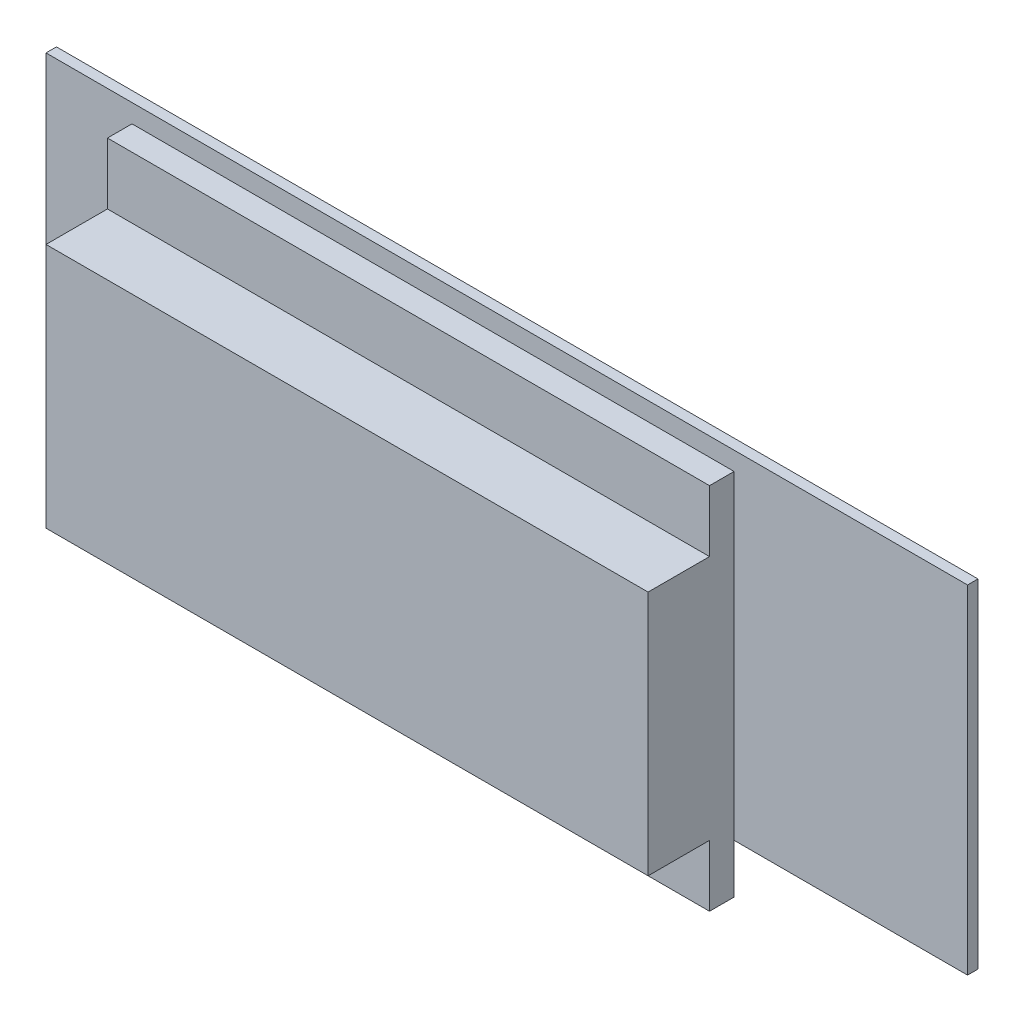
ISO-10303-21;
HEADER;
FILE_DESCRIPTION(('STEP AP214'),'2;1');
FILE_NAME('part.step','',(''),(''),'','','');
FILE_SCHEMA(('AUTOMOTIVE_DESIGN { 1 0 10303 214 1 1 1 1 }'));
ENDSEC;
DATA;
#1=APPLICATION_CONTEXT('core data for automotive mechanical design processes');
#2=APPLICATION_PROTOCOL_DEFINITION('international standard','automotive_design',2000,#1);
#3=PRODUCT_CONTEXT('',#1,'mechanical');
#4=PRODUCT('Part','Part','',(#3));
#5=PRODUCT_RELATED_PRODUCT_CATEGORY('part','',(#4));
#6=PRODUCT_DEFINITION_FORMATION('','',#4);
#7=PRODUCT_DEFINITION_CONTEXT('part definition',#1,'design');
#8=PRODUCT_DEFINITION('design','',#6,#7);
#9=PRODUCT_DEFINITION_SHAPE('','',#8);
#10=(LENGTH_UNIT() NAMED_UNIT(*) SI_UNIT(.MILLI.,.METRE.));
#11=(NAMED_UNIT(*) PLANE_ANGLE_UNIT() SI_UNIT($,.RADIAN.));
#12=(NAMED_UNIT(*) SI_UNIT($,.STERADIAN.) SOLID_ANGLE_UNIT());
#13=UNCERTAINTY_MEASURE_WITH_UNIT(LENGTH_MEASURE(1.E-05),#10,'distance_accuracy_value','');
#14=(GEOMETRIC_REPRESENTATION_CONTEXT(3) GLOBAL_UNCERTAINTY_ASSIGNED_CONTEXT((#13)) GLOBAL_UNIT_ASSIGNED_CONTEXT((#10,
#11,#12)) REPRESENTATION_CONTEXT('',''));
#15=CARTESIAN_POINT('',(0.,0.,0.));
#16=DIRECTION('',(0.,0.,1.));
#17=DIRECTION('',(1.,0.,0.));
#18=AXIS2_PLACEMENT_3D('',#15,#16,#17);
#19=CARTESIAN_POINT('',(0.,0.,5.7));
#20=DIRECTION('',(0.,0.,-1.));
#21=DIRECTION('',(-1.,0.,0.));
#22=AXIS2_PLACEMENT_3D('',#19,#20,#21);
#23=PLANE('',#22);
#24=DIRECTION('',(-1.,0.,0.));
#25=VECTOR('',#24,1.);
#26=CARTESIAN_POINT('',(-61.,14.5,5.7));
#27=LINE('',#26,#25);
#28=CARTESIAN_POINT('',(37.,14.5,5.7));
#29=VERTEX_POINT('',#28);
#30=CARTESIAN_POINT('',(-61.,14.5,5.7));
#31=VERTEX_POINT('',#30);
#32=EDGE_CURVE('E53',#29,#31,#27,.T.);
#33=ORIENTED_EDGE('',*,*,#32,.F.);
#34=DIRECTION('',(0.,1.,0.));
#35=VECTOR('',#34,1.);
#36=CARTESIAN_POINT('',(37.,24.5,5.7));
#37=LINE('',#36,#35);
#38=CARTESIAN_POINT('',(37.,24.5,5.7));
#39=VERTEX_POINT('',#38);
#40=EDGE_CURVE('E242',#29,#39,#37,.T.);
#41=ORIENTED_EDGE('',*,*,#40,.T.);
#42=DIRECTION('',(-1.,0.,0.));
#43=VECTOR('',#42,1.);
#44=CARTESIAN_POINT('',(-61.,24.5,5.7));
#45=LINE('',#44,#43);
#46=CARTESIAN_POINT('',(-61.,24.5,5.7));
#47=VERTEX_POINT('',#46);
#48=EDGE_CURVE('E178',#39,#47,#45,.T.);
#49=ORIENTED_EDGE('',*,*,#48,.T.);
#50=DIRECTION('',(0.,-1.,0.));
#51=VECTOR('',#50,1.);
#52=CARTESIAN_POINT('',(-61.,24.5,5.7));
#53=LINE('',#52,#51);
#54=EDGE_CURVE('E189',#47,#31,#53,.T.);
#55=ORIENTED_EDGE('',*,*,#54,.T.);
#56=EDGE_LOOP('',(#33,#41,#49,#55));
#57=FACE_BOUND('',#56,.T.);
#58=ADVANCED_FACE('F35',(#57),#23,.F.);
#59=DIRECTION('',(1.,0.,0.));
#60=VECTOR('',#59,1.);
#61=CARTESIAN_POINT('',(-61.,-25.5,5.7));
#62=LINE('',#61,#60);
#63=CARTESIAN_POINT('',(-61.,-25.5,5.7));
#64=VERTEX_POINT('',#63);
#65=CARTESIAN_POINT('',(37.,-25.5,5.7));
#66=VERTEX_POINT('',#65);
#67=EDGE_CURVE('E61',#64,#66,#62,.T.);
#68=ORIENTED_EDGE('',*,*,#67,.F.);
#69=CARTESIAN_POINT('',(-61.,-35.5,5.7));
#70=VERTEX_POINT('',#69);
#71=EDGE_CURVE('E156',#64,#70,#53,.T.);
#72=ORIENTED_EDGE('',*,*,#71,.T.);
#73=DIRECTION('',(1.,0.,0.));
#74=VECTOR('',#73,1.);
#75=CARTESIAN_POINT('',(-61.,-35.5,5.7));
#76=LINE('',#75,#74);
#77=CARTESIAN_POINT('',(37.,-35.5,5.7));
#78=VERTEX_POINT('',#77);
#79=EDGE_CURVE('E183',#70,#78,#76,.T.);
#80=ORIENTED_EDGE('',*,*,#79,.T.);
#81=EDGE_CURVE('E233',#78,#66,#37,.T.);
#82=ORIENTED_EDGE('',*,*,#81,.T.);
#83=EDGE_LOOP('',(#68,#72,#80,#82));
#84=FACE_BOUND('',#83,.T.);
#85=ADVANCED_FACE('F248',(#84),#23,.F.);
#86=CARTESIAN_POINT('',(-75.,-27.5,1.7));
#87=DIRECTION('',(1.,0.,0.));
#88=DIRECTION('',(0.,0.,-1.));
#89=AXIS2_PLACEMENT_3D('',#86,#87,#88);
#90=PLANE('',#89);
#91=DIRECTION('',(0.,-1.,0.));
#92=VECTOR('',#91,1.);
#93=CARTESIAN_POINT('',(-75.,-27.5,0.));
#94=LINE('',#93,#92);
#95=CARTESIAN_POINT('',(-75.,27.5,0.));
#96=VERTEX_POINT('',#95);
#97=CARTESIAN_POINT('',(-75.,-27.5,0.));
#98=VERTEX_POINT('',#97);
#99=EDGE_CURVE('E210',#96,#98,#94,.T.);
#100=ORIENTED_EDGE('',*,*,#99,.T.);
#101=DIRECTION('',(0.,0.,-1.));
#102=VECTOR('',#101,1.);
#103=CARTESIAN_POINT('',(-75.,-27.5,1.7));
#104=LINE('',#103,#102);
#105=CARTESIAN_POINT('',(-75.,-27.5,1.7));
#106=VERTEX_POINT('',#105);
#107=EDGE_CURVE('E44',#106,#98,#104,.T.);
#108=ORIENTED_EDGE('',*,*,#107,.F.);
#109=DIRECTION('',(0.,-1.,0.));
#110=VECTOR('',#109,1.);
#111=CARTESIAN_POINT('',(-75.,-27.5,1.7));
#112=LINE('',#111,#110);
#113=CARTESIAN_POINT('',(-75.,27.5,1.7));
#114=VERTEX_POINT('',#113);
#115=EDGE_CURVE('E205',#114,#106,#112,.T.);
#116=ORIENTED_EDGE('',*,*,#115,.F.);
#117=DIRECTION('',(0.,0.,-1.));
#118=VECTOR('',#117,1.);
#119=CARTESIAN_POINT('',(-75.,27.5,1.7));
#120=LINE('',#119,#118);
#121=EDGE_CURVE('E199',#114,#96,#120,.T.);
#122=ORIENTED_EDGE('',*,*,#121,.T.);
#123=EDGE_LOOP('',(#100,#108,#116,#122));
#124=FACE_BOUND('',#123,.T.);
#125=ADVANCED_FACE('F37',(#124),#90,.F.);
#126=CARTESIAN_POINT('',(75.,-27.5,1.7));
#127=DIRECTION('',(0.,1.,0.));
#128=DIRECTION('',(-1.,0.,0.));
#129=AXIS2_PLACEMENT_3D('',#126,#127,#128);
#130=PLANE('',#129);
#131=DIRECTION('',(1.,0.,0.));
#132=VECTOR('',#131,1.);
#133=CARTESIAN_POINT('',(75.,-27.5,0.));
#134=LINE('',#133,#132);
#135=CARTESIAN_POINT('',(75.,-27.5,0.));
#136=VERTEX_POINT('',#135);
#137=EDGE_CURVE('E208',#98,#136,#134,.T.);
#138=ORIENTED_EDGE('',*,*,#137,.T.);
#139=DIRECTION('',(0.,0.,-1.));
#140=VECTOR('',#139,1.);
#141=CARTESIAN_POINT('',(75.,-27.5,1.7));
#142=LINE('',#141,#140);
#143=CARTESIAN_POINT('',(75.,-27.5,1.7));
#144=VERTEX_POINT('',#143);
#145=EDGE_CURVE('E193',#144,#136,#142,.T.);
#146=ORIENTED_EDGE('',*,*,#145,.F.);
#147=DIRECTION('',(1.,0.,0.));
#148=VECTOR('',#147,1.);
#149=CARTESIAN_POINT('',(75.,-27.5,1.7));
#150=LINE('',#149,#148);
#151=CARTESIAN_POINT('',(37.,-27.5,1.7));
#152=VERTEX_POINT('',#151);
#153=EDGE_CURVE('E220',#152,#144,#150,.T.);
#154=ORIENTED_EDGE('',*,*,#153,.F.);
#155=CARTESIAN_POINT('',(-61.,-27.5,1.7));
#156=VERTEX_POINT('',#155);
#157=EDGE_CURVE('E219',#156,#152,#150,.T.);
#158=ORIENTED_EDGE('',*,*,#157,.F.);
#159=EDGE_CURVE('E217',#106,#156,#150,.T.);
#160=ORIENTED_EDGE('',*,*,#159,.F.);
#161=ORIENTED_EDGE('',*,*,#107,.T.);
#162=EDGE_LOOP('',(#138,#146,#154,#158,#160,#161));
#163=FACE_BOUND('',#162,.T.);
#164=ADVANCED_FACE('F303',(#163),#130,.F.);
#165=CARTESIAN_POINT('',(75.,-27.5,1.7));
#166=DIRECTION('',(-1.,0.,0.));
#167=DIRECTION('',(0.,0.,1.));
#168=AXIS2_PLACEMENT_3D('',#165,#166,#167);
#169=PLANE('',#168);
#170=DIRECTION('',(0.,1.,0.));
#171=VECTOR('',#170,1.);
#172=CARTESIAN_POINT('',(75.,-27.5,0.));
#173=LINE('',#172,#171);
#174=CARTESIAN_POINT('',(75.,27.5,0.));
#175=VERTEX_POINT('',#174);
#176=EDGE_CURVE('E206',#136,#175,#173,.T.);
#177=ORIENTED_EDGE('',*,*,#176,.T.);
#178=DIRECTION('',(0.,0.,-1.));
#179=VECTOR('',#178,1.);
#180=CARTESIAN_POINT('',(75.,27.5,1.7));
#181=LINE('',#180,#179);
#182=CARTESIAN_POINT('',(75.,27.5,1.7));
#183=VERTEX_POINT('',#182);
#184=EDGE_CURVE('E196',#183,#175,#181,.T.);
#185=ORIENTED_EDGE('',*,*,#184,.F.);
#186=DIRECTION('',(0.,1.,0.));
#187=VECTOR('',#186,1.);
#188=CARTESIAN_POINT('',(75.,-27.5,1.7));
#189=LINE('',#188,#187);
#190=EDGE_CURVE('E215',#144,#183,#189,.T.);
#191=ORIENTED_EDGE('',*,*,#190,.F.);
#192=ORIENTED_EDGE('',*,*,#145,.T.);
#193=EDGE_LOOP('',(#177,#185,#191,#192));
#194=FACE_BOUND('',#193,.T.);
#195=ADVANCED_FACE('F300',(#194),#169,.F.);
#196=CARTESIAN_POINT('',(75.,27.5,1.7));
#197=DIRECTION('',(0.,-1.,0.));
#198=DIRECTION('',(1.,0.,0.));
#199=AXIS2_PLACEMENT_3D('',#196,#197,#198);
#200=PLANE('',#199);
#201=DIRECTION('',(-1.,0.,0.));
#202=VECTOR('',#201,1.);
#203=CARTESIAN_POINT('',(75.,27.5,0.));
#204=LINE('',#203,#202);
#205=EDGE_CURVE('E203',#175,#96,#204,.T.);
#206=ORIENTED_EDGE('',*,*,#205,.T.);
#207=ORIENTED_EDGE('',*,*,#121,.F.);
#208=DIRECTION('',(-1.,0.,0.));
#209=VECTOR('',#208,1.);
#210=CARTESIAN_POINT('',(75.,27.5,1.7));
#211=LINE('',#210,#209);
#212=EDGE_CURVE('E202',#183,#114,#211,.T.);
#213=ORIENTED_EDGE('',*,*,#212,.F.);
#214=ORIENTED_EDGE('',*,*,#184,.T.);
#215=EDGE_LOOP('',(#206,#207,#213,#214));
#216=FACE_BOUND('',#215,.T.);
#217=ADVANCED_FACE('F293',(#216),#200,.F.);
#218=CARTESIAN_POINT('',(0.,0.,1.7));
#219=DIRECTION('',(0.,0.,1.));
#220=DIRECTION('',(1.,0.,0.));
#221=AXIS2_PLACEMENT_3D('',#218,#219,#220);
#222=PLANE('',#221);
#223=DIRECTION('',(0.,1.,0.));
#224=VECTOR('',#223,1.);
#225=CARTESIAN_POINT('',(37.,24.5,1.7));
#226=LINE('',#225,#224);
#227=CARTESIAN_POINT('',(37.,24.5,1.7));
#228=VERTEX_POINT('',#227);
#229=EDGE_CURVE('E11',#152,#228,#226,.T.);
#230=ORIENTED_EDGE('',*,*,#229,.F.);
#231=ORIENTED_EDGE('',*,*,#153,.T.);
#232=ORIENTED_EDGE('',*,*,#190,.T.);
#233=ORIENTED_EDGE('',*,*,#212,.T.);
#234=ORIENTED_EDGE('',*,*,#115,.T.);
#235=ORIENTED_EDGE('',*,*,#159,.T.);
#236=DIRECTION('',(0.,-1.,0.));
#237=VECTOR('',#236,1.);
#238=CARTESIAN_POINT('',(-61.,24.5,1.7));
#239=LINE('',#238,#237);
#240=CARTESIAN_POINT('',(-61.,24.5,1.7));
#241=VERTEX_POINT('',#240);
#242=EDGE_CURVE('E238',#241,#156,#239,.T.);
#243=ORIENTED_EDGE('',*,*,#242,.F.);
#244=DIRECTION('',(-1.,0.,0.));
#245=VECTOR('',#244,1.);
#246=CARTESIAN_POINT('',(-61.,24.5,1.7));
#247=LINE('',#246,#245);
#248=EDGE_CURVE('E157',#228,#241,#247,.T.);
#249=ORIENTED_EDGE('',*,*,#248,.F.);
#250=EDGE_LOOP('',(#230,#231,#232,#233,#234,#235,#243,#249));
#251=FACE_BOUND('',#250,.T.);
#252=ADVANCED_FACE('F290',(#251),#222,.T.);
#253=CARTESIAN_POINT('',(0.,0.,0.));
#254=DIRECTION('',(0.,0.,1.));
#255=DIRECTION('',(1.,0.,0.));
#256=AXIS2_PLACEMENT_3D('',#253,#254,#255);
#257=PLANE('',#256);
#258=ORIENTED_EDGE('',*,*,#99,.F.);
#259=ORIENTED_EDGE('',*,*,#205,.F.);
#260=ORIENTED_EDGE('',*,*,#176,.F.);
#261=ORIENTED_EDGE('',*,*,#137,.F.);
#262=EDGE_LOOP('',(#258,#259,#260,#261));
#263=FACE_BOUND('',#262,.T.);
#264=ADVANCED_FACE('F288',(#263),#257,.F.);
#265=CARTESIAN_POINT('',(-61.,24.5,5.7));
#266=DIRECTION('',(0.,-1.,0.));
#267=DIRECTION('',(0.,0.,-1.));
#268=AXIS2_PLACEMENT_3D('',#265,#266,#267);
#269=PLANE('',#268);
#270=ORIENTED_EDGE('',*,*,#248,.T.);
#271=DIRECTION('',(0.,0.,-1.));
#272=VECTOR('',#271,1.);
#273=CARTESIAN_POINT('',(-61.,24.5,5.7));
#274=LINE('',#273,#272);
#275=EDGE_CURVE('E213',#47,#241,#274,.T.);
#276=ORIENTED_EDGE('',*,*,#275,.F.);
#277=ORIENTED_EDGE('',*,*,#48,.F.);
#278=DIRECTION('',(0.,0.,-1.));
#279=VECTOR('',#278,1.);
#280=CARTESIAN_POINT('',(37.,24.5,5.7));
#281=LINE('',#280,#279);
#282=EDGE_CURVE('E231',#39,#228,#281,.T.);
#283=ORIENTED_EDGE('',*,*,#282,.T.);
#284=EDGE_LOOP('',(#270,#276,#277,#283));
#285=FACE_BOUND('',#284,.T.);
#286=ADVANCED_FACE('F285',(#285),#269,.F.);
#287=CARTESIAN_POINT('',(-61.,24.5,5.7));
#288=DIRECTION('',(1.,0.,0.));
#289=DIRECTION('',(0.,1.,0.));
#290=AXIS2_PLACEMENT_3D('',#287,#288,#289);
#291=PLANE('',#290);
#292=ORIENTED_EDGE('',*,*,#242,.T.);
#293=CARTESIAN_POINT('',(-61.,-35.5,1.7));
#294=VERTEX_POINT('',#293);
#295=EDGE_CURVE('E160',#156,#294,#239,.T.);
#296=ORIENTED_EDGE('',*,*,#295,.T.);
#297=DIRECTION('',(0.,0.,-1.));
#298=VECTOR('',#297,1.);
#299=CARTESIAN_POINT('',(-61.,-35.5,5.7));
#300=LINE('',#299,#298);
#301=EDGE_CURVE('E225',#70,#294,#300,.T.);
#302=ORIENTED_EDGE('',*,*,#301,.F.);
#303=ORIENTED_EDGE('',*,*,#71,.F.);
#304=DIRECTION('',(0.,0.,-1.));
#305=VECTOR('',#304,1.);
#306=CARTESIAN_POINT('',(-61.,-25.5,15.7));
#307=LINE('',#306,#305);
#308=CARTESIAN_POINT('',(-61.,-25.5,15.7));
#309=VERTEX_POINT('',#308);
#310=EDGE_CURVE('E137',#309,#64,#307,.T.);
#311=ORIENTED_EDGE('',*,*,#310,.F.);
#312=DIRECTION('',(0.,-1.,0.));
#313=VECTOR('',#312,1.);
#314=CARTESIAN_POINT('',(-61.,14.5,15.7));
#315=LINE('',#314,#313);
#316=CARTESIAN_POINT('',(-61.,14.5,15.7));
#317=VERTEX_POINT('',#316);
#318=EDGE_CURVE('E143',#317,#309,#315,.T.);
#319=ORIENTED_EDGE('',*,*,#318,.F.);
#320=DIRECTION('',(0.,0.,-1.));
#321=VECTOR('',#320,1.);
#322=CARTESIAN_POINT('',(-61.,14.5,15.7));
#323=LINE('',#322,#321);
#324=EDGE_CURVE('E171',#317,#31,#323,.T.);
#325=ORIENTED_EDGE('',*,*,#324,.T.);
#326=ORIENTED_EDGE('',*,*,#54,.F.);
#327=ORIENTED_EDGE('',*,*,#275,.T.);
#328=EDGE_LOOP('',(#292,#296,#302,#303,#311,#319,#325,#326,#327));
#329=FACE_BOUND('',#328,.T.);
#330=ADVANCED_FACE('F154',(#329),#291,.F.);
#331=CARTESIAN_POINT('',(-61.,-35.5,5.7));
#332=DIRECTION('',(0.,1.,0.));
#333=DIRECTION('',(0.,0.,1.));
#334=AXIS2_PLACEMENT_3D('',#331,#332,#333);
#335=PLANE('',#334);
#336=DIRECTION('',(1.,0.,0.));
#337=VECTOR('',#336,1.);
#338=CARTESIAN_POINT('',(-61.,-35.5,1.7));
#339=LINE('',#338,#337);
#340=CARTESIAN_POINT('',(37.,-35.5,1.7));
#341=VERTEX_POINT('',#340);
#342=EDGE_CURVE('E236',#294,#341,#339,.T.);
#343=ORIENTED_EDGE('',*,*,#342,.T.);
#344=DIRECTION('',(0.,0.,-1.));
#345=VECTOR('',#344,1.);
#346=CARTESIAN_POINT('',(37.,-35.5,5.7));
#347=LINE('',#346,#345);
#348=EDGE_CURVE('E228',#78,#341,#347,.T.);
#349=ORIENTED_EDGE('',*,*,#348,.F.);
#350=ORIENTED_EDGE('',*,*,#79,.F.);
#351=ORIENTED_EDGE('',*,*,#301,.T.);
#352=EDGE_LOOP('',(#343,#349,#350,#351));
#353=FACE_BOUND('',#352,.T.);
#354=ADVANCED_FACE('F250',(#353),#335,.F.);
#355=CARTESIAN_POINT('',(37.,24.5,5.7));
#356=DIRECTION('',(-1.,0.,0.));
#357=DIRECTION('',(0.,-1.,0.));
#358=AXIS2_PLACEMENT_3D('',#355,#356,#357);
#359=PLANE('',#358);
#360=EDGE_CURVE('E46',#341,#152,#226,.T.);
#361=ORIENTED_EDGE('',*,*,#360,.T.);
#362=ORIENTED_EDGE('',*,*,#229,.T.);
#363=ORIENTED_EDGE('',*,*,#282,.F.);
#364=ORIENTED_EDGE('',*,*,#40,.F.);
#365=DIRECTION('',(0.,0.,-1.));
#366=VECTOR('',#365,1.);
#367=CARTESIAN_POINT('',(37.,14.5,15.7));
#368=LINE('',#367,#366);
#369=CARTESIAN_POINT('',(37.,14.5,15.7));
#370=VERTEX_POINT('',#369);
#371=EDGE_CURVE('E162',#370,#29,#368,.T.);
#372=ORIENTED_EDGE('',*,*,#371,.F.);
#373=DIRECTION('',(0.,1.,0.));
#374=VECTOR('',#373,1.);
#375=CARTESIAN_POINT('',(37.,14.5,15.7));
#376=LINE('',#375,#374);
#377=CARTESIAN_POINT('',(37.,-25.5,15.7));
#378=VERTEX_POINT('',#377);
#379=EDGE_CURVE('E142',#378,#370,#376,.T.);
#380=ORIENTED_EDGE('',*,*,#379,.F.);
#381=DIRECTION('',(0.,0.,-1.));
#382=VECTOR('',#381,1.);
#383=CARTESIAN_POINT('',(37.,-25.5,15.7));
#384=LINE('',#383,#382);
#385=EDGE_CURVE('E139',#378,#66,#384,.T.);
#386=ORIENTED_EDGE('',*,*,#385,.T.);
#387=ORIENTED_EDGE('',*,*,#81,.F.);
#388=ORIENTED_EDGE('',*,*,#348,.T.);
#389=EDGE_LOOP('',(#361,#362,#363,#364,#372,#380,#386,#387,#388));
#390=FACE_BOUND('',#389,.T.);
#391=ADVANCED_FACE('F254',(#390),#359,.F.);
#392=CARTESIAN_POINT('',(0.,0.,1.7));
#393=DIRECTION('',(0.,0.,-1.));
#394=DIRECTION('',(-1.,0.,0.));
#395=AXIS2_PLACEMENT_3D('',#392,#393,#394);
#396=PLANE('',#395);
#397=ORIENTED_EDGE('',*,*,#295,.F.);
#398=ORIENTED_EDGE('',*,*,#157,.T.);
#399=ORIENTED_EDGE('',*,*,#360,.F.);
#400=ORIENTED_EDGE('',*,*,#342,.F.);
#401=EDGE_LOOP('',(#397,#398,#399,#400));
#402=FACE_BOUND('',#401,.T.);
#403=ADVANCED_FACE('F268',(#402),#396,.T.);
#404=CARTESIAN_POINT('',(-61.,-25.5,15.7));
#405=DIRECTION('',(0.,1.,0.));
#406=DIRECTION('',(0.,0.,1.));
#407=AXIS2_PLACEMENT_3D('',#404,#405,#406);
#408=PLANE('',#407);
#409=ORIENTED_EDGE('',*,*,#67,.T.);
#410=ORIENTED_EDGE('',*,*,#385,.F.);
#411=DIRECTION('',(1.,0.,0.));
#412=VECTOR('',#411,1.);
#413=CARTESIAN_POINT('',(-61.,-25.5,15.7));
#414=LINE('',#413,#412);
#415=EDGE_CURVE('E133',#309,#378,#414,.T.);
#416=ORIENTED_EDGE('',*,*,#415,.F.);
#417=ORIENTED_EDGE('',*,*,#310,.T.);
#418=EDGE_LOOP('',(#409,#410,#416,#417));
#419=FACE_BOUND('',#418,.T.);
#420=ADVANCED_FACE('F135',(#419),#408,.F.);
#421=CARTESIAN_POINT('',(-61.,14.5,15.7));
#422=DIRECTION('',(0.,-1.,0.));
#423=DIRECTION('',(0.,0.,-1.));
#424=AXIS2_PLACEMENT_3D('',#421,#422,#423);
#425=PLANE('',#424);
#426=ORIENTED_EDGE('',*,*,#32,.T.);
#427=ORIENTED_EDGE('',*,*,#324,.F.);
#428=DIRECTION('',(-1.,0.,0.));
#429=VECTOR('',#428,1.);
#430=CARTESIAN_POINT('',(-61.,14.5,15.7));
#431=LINE('',#430,#429);
#432=EDGE_CURVE('E148',#370,#317,#431,.T.);
#433=ORIENTED_EDGE('',*,*,#432,.F.);
#434=ORIENTED_EDGE('',*,*,#371,.T.);
#435=EDGE_LOOP('',(#426,#427,#433,#434));
#436=FACE_BOUND('',#435,.T.);
#437=ADVANCED_FACE('F260',(#436),#425,.F.);
#438=CARTESIAN_POINT('',(0.,0.,15.7));
#439=DIRECTION('',(0.,0.,1.));
#440=DIRECTION('',(1.,0.,0.));
#441=AXIS2_PLACEMENT_3D('',#438,#439,#440);
#442=PLANE('',#441);
#443=ORIENTED_EDGE('',*,*,#318,.T.);
#444=ORIENTED_EDGE('',*,*,#415,.T.);
#445=ORIENTED_EDGE('',*,*,#379,.T.);
#446=ORIENTED_EDGE('',*,*,#432,.T.);
#447=EDGE_LOOP('',(#443,#444,#445,#446));
#448=FACE_BOUND('',#447,.T.);
#449=ADVANCED_FACE('F146',(#448),#442,.T.);
#450=CLOSED_SHELL('',(#58,#85,#125,#164,#195,#217,#252,#264,#286,#330,#354,#391,#403,#420,#437,#449));
#451=MANIFOLD_SOLID_BREP('B2',#450);
#452=ADVANCED_BREP_SHAPE_REPRESENTATION('',(#18,#451),#14);
#453=SHAPE_DEFINITION_REPRESENTATION(#9,#452);
ENDSEC;
END-ISO-10303-21;
